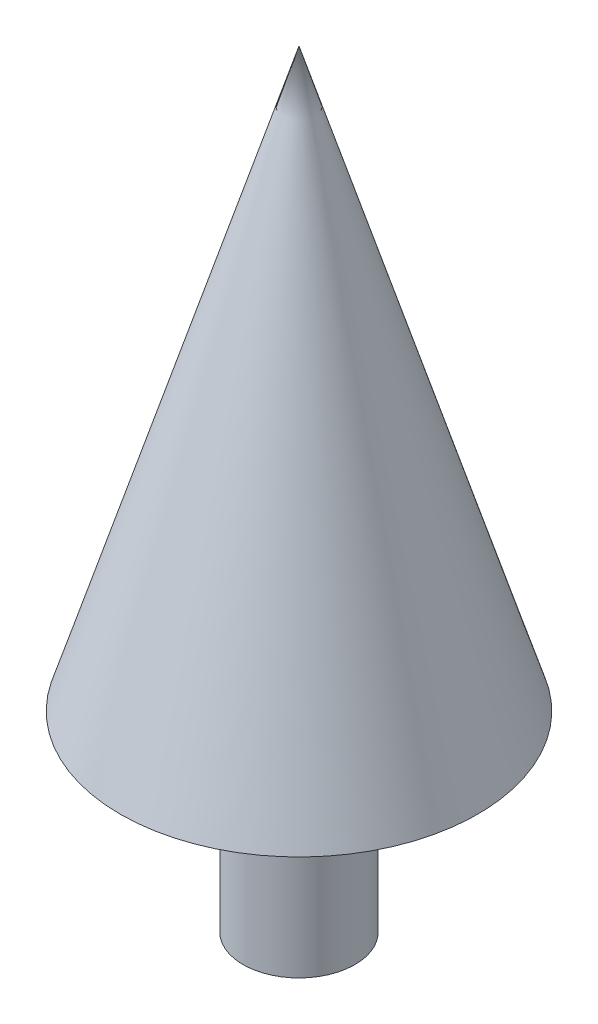
ISO-10303-21;
HEADER;
FILE_DESCRIPTION(('STEP AP214'),'2;1');
FILE_NAME('part.step','',(''),(''),'','','');
FILE_SCHEMA(('AUTOMOTIVE_DESIGN { 1 0 10303 214 1 1 1 1 }'));
ENDSEC;
DATA;
#1=APPLICATION_CONTEXT('core data for automotive mechanical design processes');
#2=APPLICATION_PROTOCOL_DEFINITION('international standard','automotive_design',2000,#1);
#3=PRODUCT_CONTEXT('',#1,'mechanical');
#4=PRODUCT('Part','Part','',(#3));
#5=PRODUCT_RELATED_PRODUCT_CATEGORY('part','',(#4));
#6=PRODUCT_DEFINITION_FORMATION('','',#4);
#7=PRODUCT_DEFINITION_CONTEXT('part definition',#1,'design');
#8=PRODUCT_DEFINITION('design','',#6,#7);
#9=PRODUCT_DEFINITION_SHAPE('','',#8);
#10=(LENGTH_UNIT() NAMED_UNIT(*) SI_UNIT(.MILLI.,.METRE.));
#11=(NAMED_UNIT(*) PLANE_ANGLE_UNIT() SI_UNIT($,.RADIAN.));
#12=(NAMED_UNIT(*) SI_UNIT($,.STERADIAN.) SOLID_ANGLE_UNIT());
#13=UNCERTAINTY_MEASURE_WITH_UNIT(LENGTH_MEASURE(1.E-05),#10,'distance_accuracy_value','');
#14=(GEOMETRIC_REPRESENTATION_CONTEXT(3) GLOBAL_UNCERTAINTY_ASSIGNED_CONTEXT((#13)) GLOBAL_UNIT_ASSIGNED_CONTEXT((#10,
#11,#12)) REPRESENTATION_CONTEXT('',''));
#15=CARTESIAN_POINT('',(0.,0.,0.));
#16=DIRECTION('',(0.,0.,1.));
#17=DIRECTION('',(1.,0.,0.));
#18=AXIS2_PLACEMENT_3D('',#15,#16,#17);
#19=CARTESIAN_POINT('',(32.8220747329123,0.,0.));
#20=DIRECTION('',(0.,-1.,0.));
#21=DIRECTION('',(0.,0.,-1.));
#22=AXIS2_PLACEMENT_3D('',#19,#20,#21);
#23=PLANE('',#22);
#24=CARTESIAN_POINT('',(0.,0.,0.));
#25=DIRECTION('',(0.,-1.,0.));
#26=DIRECTION('',(0.,0.,-1.));
#27=AXIS2_PLACEMENT_3D('',#24,#25,#26);
#28=CIRCLE('',#27,32.8220747329123);
#29=CARTESIAN_POINT('',(0.,0.,-32.8220747329123));
#30=VERTEX_POINT('',#29);
#31=EDGE_CURVE('E58',#30,#30,#28,.T.);
#32=ORIENTED_EDGE('',*,*,#31,.T.);
#33=EDGE_LOOP('',(#32));
#34=FACE_BOUND('',#33,.T.);
#35=ADVANCED_FACE('F36',(#34),#23,.T.);
#36=CARTESIAN_POINT('',(0.,112.325719712877,0.));
#37=DIRECTION('',(0.,-1.,0.));
#38=DIRECTION('',(0.,0.,-1.));
#39=AXIS2_PLACEMENT_3D('',#36,#37,#38);
#40=CONICAL_SURFACE('',#39,104.792134424099,0.300911234068391);
#41=CARTESIAN_POINT('',(0.,450.,0.));
#42=VERTEX_POINT('',#41);
#43=VERTEX_LOOP('',#42);
#44=FACE_BOUND('',#43,.T.);
#45=CARTESIAN_POINT('',(0.,112.325719712877,0.));
#46=DIRECTION('',(0.,-1.,0.));
#47=DIRECTION('',(0.,0.,-1.));
#48=AXIS2_PLACEMENT_3D('',#45,#46,#47);
#49=CIRCLE('',#48,104.792134424099);
#50=CARTESIAN_POINT('',(0.,112.325719712877,-104.792134424099));
#51=VERTEX_POINT('',#50);
#52=EDGE_CURVE('E11',#51,#51,#49,.T.);
#53=ORIENTED_EDGE('',*,*,#52,.F.);
#54=EDGE_LOOP('',(#53));
#55=FACE_BOUND('',#54,.T.);
#56=ADVANCED_FACE('F45',(#44,#55),#40,.T.);
#57=CARTESIAN_POINT('',(104.792134424099,112.325719712877,0.));
#58=DIRECTION('',(0.,-1.,0.));
#59=DIRECTION('',(0.,0.,-1.));
#60=AXIS2_PLACEMENT_3D('',#57,#58,#59);
#61=PLANE('',#60);
#62=ORIENTED_EDGE('',*,*,#52,.T.);
#63=EDGE_LOOP('',(#62));
#64=FACE_BOUND('',#63,.T.);
#65=CARTESIAN_POINT('',(0.,112.325719712877,0.));
#66=DIRECTION('',(0.,-1.,0.));
#67=DIRECTION('',(0.,0.,-1.));
#68=AXIS2_PLACEMENT_3D('',#65,#66,#67);
#69=CIRCLE('',#68,32.8220747329123);
#70=CARTESIAN_POINT('',(0.,112.325719712877,-32.8220747329123));
#71=VERTEX_POINT('',#70);
#72=EDGE_CURVE('E42',#71,#71,#69,.T.);
#73=ORIENTED_EDGE('',*,*,#72,.F.);
#74=EDGE_LOOP('',(#73));
#75=FACE_BOUND('',#74,.T.);
#76=ADVANCED_FACE('F48',(#64,#75),#61,.T.);
#77=CARTESIAN_POINT('',(0.,0.,0.));
#78=DIRECTION('',(0.,-1.,0.));
#79=DIRECTION('',(0.,0.,-1.));
#80=AXIS2_PLACEMENT_3D('',#77,#78,#79);
#81=CYLINDRICAL_SURFACE('',#80,32.8220747329123);
#82=ORIENTED_EDGE('',*,*,#72,.T.);
#83=EDGE_LOOP('',(#82));
#84=FACE_BOUND('',#83,.T.);
#85=ORIENTED_EDGE('',*,*,#31,.F.);
#86=EDGE_LOOP('',(#85));
#87=FACE_BOUND('',#86,.T.);
#88=ADVANCED_FACE('F53',(#84,#87),#81,.T.);
#89=CLOSED_SHELL('',(#35,#56,#76,#88));
#90=MANIFOLD_SOLID_BREP('B2',#89);
#91=ADVANCED_BREP_SHAPE_REPRESENTATION('',(#18,#90),#14);
#92=SHAPE_DEFINITION_REPRESENTATION(#9,#91);
ENDSEC;
END-ISO-10303-21;
